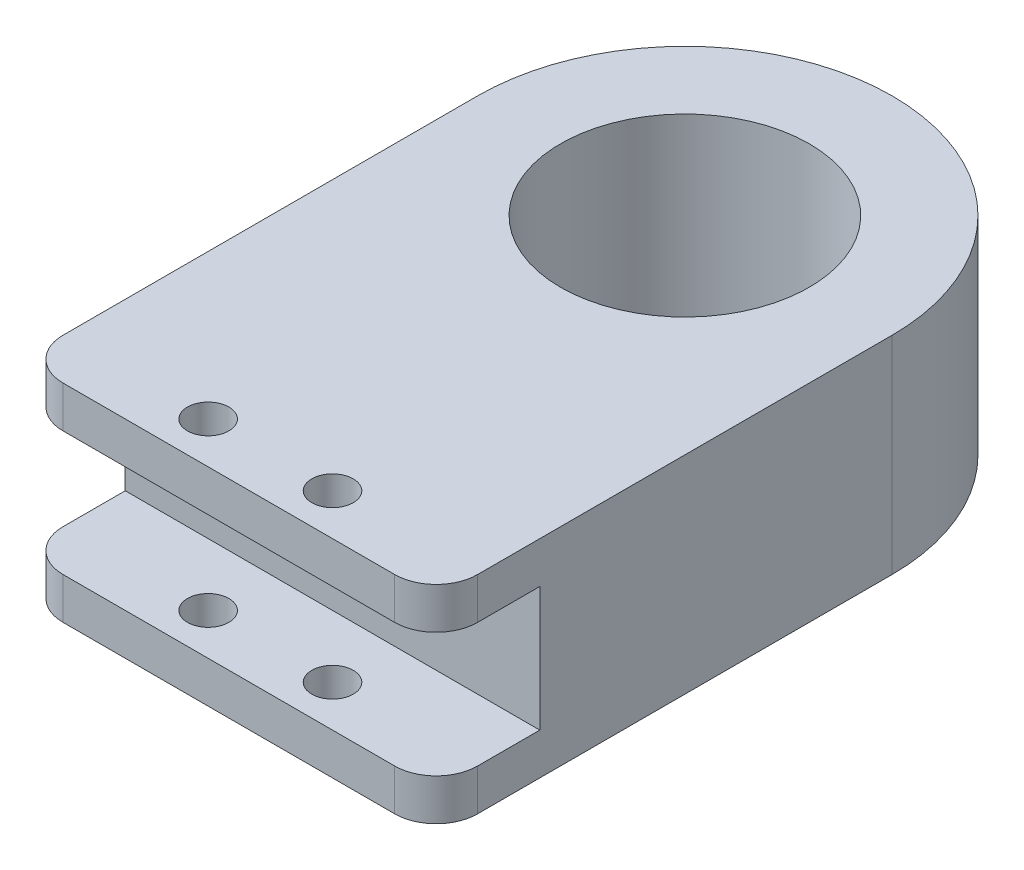
ISO-10303-21;
HEADER;
FILE_DESCRIPTION(('STEP AP214'),'2;1');
FILE_NAME('part.step','',(''),(''),'','','');
FILE_SCHEMA(('AUTOMOTIVE_DESIGN { 1 0 10303 214 1 1 1 1 }'));
ENDSEC;
DATA;
#1=APPLICATION_CONTEXT('core data for automotive mechanical design processes');
#2=APPLICATION_PROTOCOL_DEFINITION('international standard','automotive_design',2000,#1);
#3=PRODUCT_CONTEXT('',#1,'mechanical');
#4=PRODUCT('Part','Part','',(#3));
#5=PRODUCT_RELATED_PRODUCT_CATEGORY('part','',(#4));
#6=PRODUCT_DEFINITION_FORMATION('','',#4);
#7=PRODUCT_DEFINITION_CONTEXT('part definition',#1,'design');
#8=PRODUCT_DEFINITION('design','',#6,#7);
#9=PRODUCT_DEFINITION_SHAPE('','',#8);
#10=(LENGTH_UNIT() NAMED_UNIT(*) SI_UNIT(.MILLI.,.METRE.));
#11=(NAMED_UNIT(*) PLANE_ANGLE_UNIT() SI_UNIT($,.RADIAN.));
#12=(NAMED_UNIT(*) SI_UNIT($,.STERADIAN.) SOLID_ANGLE_UNIT());
#13=UNCERTAINTY_MEASURE_WITH_UNIT(LENGTH_MEASURE(1.E-05),#10,'distance_accuracy_value','');
#14=(GEOMETRIC_REPRESENTATION_CONTEXT(3) GLOBAL_UNCERTAINTY_ASSIGNED_CONTEXT((#13)) GLOBAL_UNIT_ASSIGNED_CONTEXT((#10,
#11,#12)) REPRESENTATION_CONTEXT('',''));
#15=CARTESIAN_POINT('',(0.,0.,0.));
#16=DIRECTION('',(0.,0.,1.));
#17=DIRECTION('',(1.,0.,0.));
#18=AXIS2_PLACEMENT_3D('',#15,#16,#17);
#19=CARTESIAN_POINT('',(-40.,50.,100.));
#20=DIRECTION('',(0.,-1.,0.));
#21=DIRECTION('',(0.,0.,-1.));
#22=AXIS2_PLACEMENT_3D('',#19,#20,#21);
#23=CYLINDRICAL_SURFACE('',#22,10.);
#24=DIRECTION('',(0.,-1.,0.));
#25=VECTOR('',#24,1.);
#26=CARTESIAN_POINT('',(-50.,50.,100.));
#27=LINE('',#26,#25);
#28=CARTESIAN_POINT('',(-50.,50.,100.));
#29=VERTEX_POINT('',#28);
#30=CARTESIAN_POINT('',(-50.,40.,100.));
#31=VERTEX_POINT('',#30);
#32=EDGE_CURVE('E158',#29,#31,#27,.T.);
#33=ORIENTED_EDGE('',*,*,#32,.T.);
#34=CARTESIAN_POINT('',(-40.,40.,100.));
#35=DIRECTION('',(0.,1.,0.));
#36=DIRECTION('',(0.,0.,1.));
#37=AXIS2_PLACEMENT_3D('',#34,#35,#36);
#38=CIRCLE('',#37,10.);
#39=CARTESIAN_POINT('',(-39.9999999999999,40.,110.));
#40=VERTEX_POINT('',#39);
#41=EDGE_CURVE('E122',#31,#40,#38,.T.);
#42=ORIENTED_EDGE('',*,*,#41,.T.);
#43=DIRECTION('',(0.,-1.,0.));
#44=VECTOR('',#43,1.);
#45=CARTESIAN_POINT('',(-39.9999999999999,50.,110.));
#46=LINE('',#45,#44);
#47=CARTESIAN_POINT('',(-39.9999999999999,50.,110.));
#48=VERTEX_POINT('',#47);
#49=EDGE_CURVE('E119',#48,#40,#46,.T.);
#50=ORIENTED_EDGE('',*,*,#49,.F.);
#51=CARTESIAN_POINT('',(-40.,50.,100.));
#52=DIRECTION('',(0.,1.,0.));
#53=DIRECTION('',(0.,0.,-1.));
#54=AXIS2_PLACEMENT_3D('',#51,#52,#53);
#55=CIRCLE('',#54,10.);
#56=EDGE_CURVE('E104',#29,#48,#55,.T.);
#57=ORIENTED_EDGE('',*,*,#56,.F.);
#58=EDGE_LOOP('',(#33,#42,#50,#57));
#59=FACE_BOUND('',#58,.T.);
#60=ADVANCED_FACE('F34',(#59),#23,.T.);
#61=CARTESIAN_POINT('',(39.9999999999999,50.,110.));
#62=DIRECTION('',(0.,0.,-1.));
#63=DIRECTION('',(-1.,0.,0.));
#64=AXIS2_PLACEMENT_3D('',#61,#62,#63);
#65=PLANE('',#64);
#66=ORIENTED_EDGE('',*,*,#49,.T.);
#67=DIRECTION('',(1.,0.,0.));
#68=VECTOR('',#67,1.);
#69=CARTESIAN_POINT('',(-50.,40.,110.));
#70=LINE('',#69,#68);
#71=CARTESIAN_POINT('',(40.,40.,110.));
#72=VERTEX_POINT('',#71);
#73=EDGE_CURVE('E164',#40,#72,#70,.T.);
#74=ORIENTED_EDGE('',*,*,#73,.T.);
#75=DIRECTION('',(0.,-1.,0.));
#76=VECTOR('',#75,1.);
#77=CARTESIAN_POINT('',(39.9999999999999,50.,110.));
#78=LINE('',#77,#76);
#79=CARTESIAN_POINT('',(39.9999999999999,50.,110.));
#80=VERTEX_POINT('',#79);
#81=EDGE_CURVE('E130',#80,#72,#78,.T.);
#82=ORIENTED_EDGE('',*,*,#81,.F.);
#83=DIRECTION('',(1.,0.,0.));
#84=VECTOR('',#83,1.);
#85=CARTESIAN_POINT('',(39.9999999999999,50.,110.));
#86=LINE('',#85,#84);
#87=EDGE_CURVE('E109',#48,#80,#86,.T.);
#88=ORIENTED_EDGE('',*,*,#87,.F.);
#89=EDGE_LOOP('',(#66,#74,#82,#88));
#90=FACE_BOUND('',#89,.T.);
#91=ADVANCED_FACE('F128',(#90),#65,.F.);
#92=CARTESIAN_POINT('',(40.,50.,100.));
#93=DIRECTION('',(0.,-1.,0.));
#94=DIRECTION('',(0.,0.,-1.));
#95=AXIS2_PLACEMENT_3D('',#92,#93,#94);
#96=CYLINDRICAL_SURFACE('',#95,10.);
#97=ORIENTED_EDGE('',*,*,#81,.T.);
#98=CARTESIAN_POINT('',(40.,40.,100.));
#99=DIRECTION('',(0.,1.,0.));
#100=DIRECTION('',(0.,0.,1.));
#101=AXIS2_PLACEMENT_3D('',#98,#99,#100);
#102=CIRCLE('',#101,10.);
#103=CARTESIAN_POINT('',(50.,40.,100.));
#104=VERTEX_POINT('',#103);
#105=EDGE_CURVE('E191',#72,#104,#102,.T.);
#106=ORIENTED_EDGE('',*,*,#105,.T.);
#107=DIRECTION('',(0.,-1.,0.));
#108=VECTOR('',#107,1.);
#109=CARTESIAN_POINT('',(50.,50.,100.));
#110=LINE('',#109,#108);
#111=CARTESIAN_POINT('',(50.,50.,100.));
#112=VERTEX_POINT('',#111);
#113=EDGE_CURVE('E154',#112,#104,#110,.T.);
#114=ORIENTED_EDGE('',*,*,#113,.F.);
#115=CARTESIAN_POINT('',(40.,50.,100.));
#116=DIRECTION('',(0.,1.,0.));
#117=DIRECTION('',(0.,0.,-1.));
#118=AXIS2_PLACEMENT_3D('',#115,#116,#117);
#119=CIRCLE('',#118,10.);
#120=EDGE_CURVE('E132',#80,#112,#119,.T.);
#121=ORIENTED_EDGE('',*,*,#120,.F.);
#122=EDGE_LOOP('',(#97,#106,#114,#121));
#123=FACE_BOUND('',#122,.T.);
#124=ADVANCED_FACE('F265',(#123),#96,.T.);
#125=CARTESIAN_POINT('',(-15.,50.,100.));
#126=DIRECTION('',(0.,-1.,0.));
#127=DIRECTION('',(0.,0.,-1.));
#128=AXIS2_PLACEMENT_3D('',#125,#126,#127);
#129=CYLINDRICAL_SURFACE('',#128,5.);
#130=CARTESIAN_POINT('',(-15.,40.,100.));
#131=DIRECTION('',(0.,1.,0.));
#132=DIRECTION('',(0.,0.,1.));
#133=AXIS2_PLACEMENT_3D('',#130,#131,#132);
#134=CIRCLE('',#133,5.);
#135=CARTESIAN_POINT('',(-15.,40.,105.));
#136=VERTEX_POINT('',#135);
#137=EDGE_CURVE('E188',#136,#136,#134,.T.);
#138=ORIENTED_EDGE('',*,*,#137,.F.);
#139=EDGE_LOOP('',(#138));
#140=FACE_BOUND('',#139,.T.);
#141=CARTESIAN_POINT('',(-15.,50.,100.));
#142=DIRECTION('',(0.,1.,0.));
#143=DIRECTION('',(0.,0.,1.));
#144=AXIS2_PLACEMENT_3D('',#141,#142,#143);
#145=CIRCLE('',#144,5.);
#146=CARTESIAN_POINT('',(-15.,50.,105.));
#147=VERTEX_POINT('',#146);
#148=EDGE_CURVE('E202',#147,#147,#145,.T.);
#149=ORIENTED_EDGE('',*,*,#148,.T.);
#150=EDGE_LOOP('',(#149));
#151=FACE_BOUND('',#150,.T.);
#152=ADVANCED_FACE('F267',(#140,#151),#129,.F.);
#153=CARTESIAN_POINT('',(15.,50.,100.));
#154=DIRECTION('',(0.,-1.,0.));
#155=DIRECTION('',(0.,0.,-1.));
#156=AXIS2_PLACEMENT_3D('',#153,#154,#155);
#157=CYLINDRICAL_SURFACE('',#156,5.);
#158=CARTESIAN_POINT('',(15.,40.,100.));
#159=DIRECTION('',(0.,1.,0.));
#160=DIRECTION('',(0.,0.,1.));
#161=AXIS2_PLACEMENT_3D('',#158,#159,#160);
#162=CIRCLE('',#161,5.);
#163=CARTESIAN_POINT('',(15.,40.,105.));
#164=VERTEX_POINT('',#163);
#165=EDGE_CURVE('E38',#164,#164,#162,.T.);
#166=ORIENTED_EDGE('',*,*,#165,.F.);
#167=EDGE_LOOP('',(#166));
#168=FACE_BOUND('',#167,.T.);
#169=CARTESIAN_POINT('',(15.,50.,100.));
#170=DIRECTION('',(0.,1.,0.));
#171=DIRECTION('',(0.,0.,-1.));
#172=AXIS2_PLACEMENT_3D('',#169,#170,#171);
#173=CIRCLE('',#172,5.);
#174=CARTESIAN_POINT('',(15.,50.,95.));
#175=VERTEX_POINT('',#174);
#176=EDGE_CURVE('E196',#175,#175,#173,.T.);
#177=ORIENTED_EDGE('',*,*,#176,.T.);
#178=EDGE_LOOP('',(#177));
#179=FACE_BOUND('',#178,.T.);
#180=ADVANCED_FACE('F274',(#168,#179),#157,.F.);
#181=CARTESIAN_POINT('',(0.,50.,0.));
#182=DIRECTION('',(0.,1.,0.));
#183=DIRECTION('',(0.,0.,1.));
#184=AXIS2_PLACEMENT_3D('',#181,#182,#183);
#185=PLANE('',#184);
#186=ORIENTED_EDGE('',*,*,#148,.F.);
#187=EDGE_LOOP('',(#186));
#188=FACE_BOUND('',#187,.T.);
#189=DIRECTION('',(0.,0.,-1.));
#190=VECTOR('',#189,1.);
#191=CARTESIAN_POINT('',(50.,50.,60.));
#192=LINE('',#191,#190);
#193=CARTESIAN_POINT('',(50.,50.,0.));
#194=VERTEX_POINT('',#193);
#195=EDGE_CURVE('E60',#112,#194,#192,.T.);
#196=ORIENTED_EDGE('',*,*,#195,.T.);
#197=CARTESIAN_POINT('',(0.,50.,0.));
#198=DIRECTION('',(0.,1.,0.));
#199=DIRECTION('',(0.,0.,1.));
#200=AXIS2_PLACEMENT_3D('',#197,#198,#199);
#201=CIRCLE('',#200,50.);
#202=CARTESIAN_POINT('',(-50.,50.,0.));
#203=VERTEX_POINT('',#202);
#204=EDGE_CURVE('E94',#194,#203,#201,.T.);
#205=ORIENTED_EDGE('',*,*,#204,.T.);
#206=DIRECTION('',(0.,0.,1.));
#207=VECTOR('',#206,1.);
#208=CARTESIAN_POINT('',(-50.,50.,60.));
#209=LINE('',#208,#207);
#210=EDGE_CURVE('E112',#203,#29,#209,.T.);
#211=ORIENTED_EDGE('',*,*,#210,.T.);
#212=ORIENTED_EDGE('',*,*,#56,.T.);
#213=ORIENTED_EDGE('',*,*,#87,.T.);
#214=ORIENTED_EDGE('',*,*,#120,.T.);
#215=EDGE_LOOP('',(#196,#205,#211,#212,#213,#214));
#216=FACE_BOUND('',#215,.T.);
#217=CARTESIAN_POINT('',(0.,50.,0.));
#218=DIRECTION('',(0.,1.,0.));
#219=DIRECTION('',(0.,0.,1.));
#220=AXIS2_PLACEMENT_3D('',#217,#218,#219);
#221=CIRCLE('',#220,30.);
#222=CARTESIAN_POINT('',(0.,50.,30.));
#223=VERTEX_POINT('',#222);
#224=EDGE_CURVE('E141',#223,#223,#221,.T.);
#225=ORIENTED_EDGE('',*,*,#224,.F.);
#226=EDGE_LOOP('',(#225));
#227=FACE_BOUND('',#226,.T.);
#228=ORIENTED_EDGE('',*,*,#176,.F.);
#229=EDGE_LOOP('',(#228));
#230=FACE_BOUND('',#229,.T.);
#231=ADVANCED_FACE('F106',(#188,#216,#227,#230),#185,.T.);
#232=CARTESIAN_POINT('',(0.,0.,0.));
#233=DIRECTION('',(0.,1.,0.));
#234=DIRECTION('',(0.,0.,1.));
#235=AXIS2_PLACEMENT_3D('',#232,#233,#234);
#236=PLANE('',#235);
#237=CARTESIAN_POINT('',(0.,0.,0.));
#238=DIRECTION('',(0.,1.,0.));
#239=DIRECTION('',(0.,0.,1.));
#240=AXIS2_PLACEMENT_3D('',#237,#238,#239);
#241=CIRCLE('',#240,50.);
#242=CARTESIAN_POINT('',(50.,0.,0.));
#243=VERTEX_POINT('',#242);
#244=CARTESIAN_POINT('',(-50.,0.,0.));
#245=VERTEX_POINT('',#244);
#246=EDGE_CURVE('E137',#243,#245,#241,.T.);
#247=ORIENTED_EDGE('',*,*,#246,.F.);
#248=DIRECTION('',(0.,0.,-1.));
#249=VECTOR('',#248,1.);
#250=CARTESIAN_POINT('',(50.,0.,60.));
#251=LINE('',#250,#249);
#252=CARTESIAN_POINT('',(50.,0.,100.));
#253=VERTEX_POINT('',#252);
#254=EDGE_CURVE('E152',#253,#243,#251,.T.);
#255=ORIENTED_EDGE('',*,*,#254,.F.);
#256=CARTESIAN_POINT('',(40.,0.,100.));
#257=DIRECTION('',(0.,1.,0.));
#258=DIRECTION('',(0.,0.,-1.));
#259=AXIS2_PLACEMENT_3D('',#256,#257,#258);
#260=CIRCLE('',#259,10.);
#261=CARTESIAN_POINT('',(39.9999999999999,0.,110.));
#262=VERTEX_POINT('',#261);
#263=EDGE_CURVE('E150',#262,#253,#260,.T.);
#264=ORIENTED_EDGE('',*,*,#263,.F.);
#265=DIRECTION('',(1.,0.,0.));
#266=VECTOR('',#265,1.);
#267=CARTESIAN_POINT('',(39.9999999999999,0.,110.));
#268=LINE('',#267,#266);
#269=CARTESIAN_POINT('',(-39.9999999999999,0.,110.));
#270=VERTEX_POINT('',#269);
#271=EDGE_CURVE('E147',#270,#262,#268,.T.);
#272=ORIENTED_EDGE('',*,*,#271,.F.);
#273=CARTESIAN_POINT('',(-40.,0.,100.));
#274=DIRECTION('',(0.,1.,0.));
#275=DIRECTION('',(0.,0.,-1.));
#276=AXIS2_PLACEMENT_3D('',#273,#274,#275);
#277=CIRCLE('',#276,10.);
#278=CARTESIAN_POINT('',(-50.,0.,100.));
#279=VERTEX_POINT('',#278);
#280=EDGE_CURVE('E144',#279,#270,#277,.T.);
#281=ORIENTED_EDGE('',*,*,#280,.F.);
#282=DIRECTION('',(0.,0.,1.));
#283=VECTOR('',#282,1.);
#284=CARTESIAN_POINT('',(-50.,0.,60.));
#285=LINE('',#284,#283);
#286=EDGE_CURVE('E140',#245,#279,#285,.T.);
#287=ORIENTED_EDGE('',*,*,#286,.F.);
#288=EDGE_LOOP('',(#247,#255,#264,#272,#281,#287));
#289=FACE_BOUND('',#288,.T.);
#290=CARTESIAN_POINT('',(0.,0.,0.));
#291=DIRECTION('',(0.,1.,0.));
#292=DIRECTION('',(0.,0.,1.));
#293=AXIS2_PLACEMENT_3D('',#290,#291,#292);
#294=CIRCLE('',#293,30.);
#295=CARTESIAN_POINT('',(0.,0.,30.));
#296=VERTEX_POINT('',#295);
#297=EDGE_CURVE('E205',#296,#296,#294,.T.);
#298=ORIENTED_EDGE('',*,*,#297,.T.);
#299=EDGE_LOOP('',(#298));
#300=FACE_BOUND('',#299,.T.);
#301=CARTESIAN_POINT('',(-15.,0.,100.));
#302=DIRECTION('',(0.,1.,0.));
#303=DIRECTION('',(0.,0.,1.));
#304=AXIS2_PLACEMENT_3D('',#301,#302,#303);
#305=CIRCLE('',#304,5.);
#306=CARTESIAN_POINT('',(-15.,0.,105.));
#307=VERTEX_POINT('',#306);
#308=EDGE_CURVE('E199',#307,#307,#305,.T.);
#309=ORIENTED_EDGE('',*,*,#308,.T.);
#310=EDGE_LOOP('',(#309));
#311=FACE_BOUND('',#310,.T.);
#312=CARTESIAN_POINT('',(15.,0.,100.));
#313=DIRECTION('',(0.,1.,0.));
#314=DIRECTION('',(0.,0.,-1.));
#315=AXIS2_PLACEMENT_3D('',#312,#313,#314);
#316=CIRCLE('',#315,5.);
#317=CARTESIAN_POINT('',(15.,0.,95.));
#318=VERTEX_POINT('',#317);
#319=EDGE_CURVE('E195',#318,#318,#316,.T.);
#320=ORIENTED_EDGE('',*,*,#319,.T.);
#321=EDGE_LOOP('',(#320));
#322=FACE_BOUND('',#321,.T.);
#323=ADVANCED_FACE('F303',(#289,#300,#311,#322),#236,.F.);
#324=CARTESIAN_POINT('',(0.,50.,0.));
#325=DIRECTION('',(0.,-1.,0.));
#326=DIRECTION('',(0.,0.,-1.));
#327=AXIS2_PLACEMENT_3D('',#324,#325,#326);
#328=CYLINDRICAL_SURFACE('',#327,50.);
#329=ORIENTED_EDGE('',*,*,#246,.T.);
#330=DIRECTION('',(0.,-1.,0.));
#331=VECTOR('',#330,1.);
#332=CARTESIAN_POINT('',(-50.,50.,0.));
#333=LINE('',#332,#331);
#334=EDGE_CURVE('E43',#203,#245,#333,.T.);
#335=ORIENTED_EDGE('',*,*,#334,.F.);
#336=ORIENTED_EDGE('',*,*,#204,.F.);
#337=DIRECTION('',(0.,-1.,0.));
#338=VECTOR('',#337,1.);
#339=CARTESIAN_POINT('',(50.,50.,0.));
#340=LINE('',#339,#338);
#341=EDGE_CURVE('E11',#194,#243,#340,.T.);
#342=ORIENTED_EDGE('',*,*,#341,.T.);
#343=EDGE_LOOP('',(#329,#335,#336,#342));
#344=FACE_BOUND('',#343,.T.);
#345=ADVANCED_FACE('F36',(#344),#328,.T.);
#346=CARTESIAN_POINT('',(-50.,50.,60.));
#347=DIRECTION('',(1.,0.,0.));
#348=DIRECTION('',(0.,0.,-1.));
#349=AXIS2_PLACEMENT_3D('',#346,#347,#348);
#350=PLANE('',#349);
#351=DIRECTION('',(0.,1.,0.));
#352=VECTOR('',#351,1.);
#353=CARTESIAN_POINT('',(-50.,40.,85.));
#354=LINE('',#353,#352);
#355=CARTESIAN_POINT('',(-50.,10.,85.));
#356=VERTEX_POINT('',#355);
#357=CARTESIAN_POINT('',(-50.,40.,85.));
#358=VERTEX_POINT('',#357);
#359=EDGE_CURVE('E251',#356,#358,#354,.T.);
#360=ORIENTED_EDGE('',*,*,#359,.T.);
#361=DIRECTION('',(0.,0.,1.));
#362=VECTOR('',#361,1.);
#363=CARTESIAN_POINT('',(-50.,40.,110.));
#364=LINE('',#363,#362);
#365=EDGE_CURVE('E182',#358,#31,#364,.T.);
#366=ORIENTED_EDGE('',*,*,#365,.T.);
#367=ORIENTED_EDGE('',*,*,#32,.F.);
#368=ORIENTED_EDGE('',*,*,#210,.F.);
#369=ORIENTED_EDGE('',*,*,#334,.T.);
#370=ORIENTED_EDGE('',*,*,#286,.T.);
#371=CARTESIAN_POINT('',(-50.,10.,100.));
#372=VERTEX_POINT('',#371);
#373=EDGE_CURVE('E125',#372,#279,#27,.T.);
#374=ORIENTED_EDGE('',*,*,#373,.F.);
#375=DIRECTION('',(0.,0.,-1.));
#376=VECTOR('',#375,1.);
#377=CARTESIAN_POINT('',(-50.,10.,110.));
#378=LINE('',#377,#376);
#379=EDGE_CURVE('E246',#372,#356,#378,.T.);
#380=ORIENTED_EDGE('',*,*,#379,.T.);
#381=EDGE_LOOP('',(#360,#366,#367,#368,#369,#370,#374,#380));
#382=FACE_BOUND('',#381,.T.);
#383=ADVANCED_FACE('F216',(#382),#350,.F.);
#384=CARTESIAN_POINT('',(-39.9999999999999,10.,110.));
#385=VERTEX_POINT('',#384);
#386=EDGE_CURVE('E126',#385,#270,#46,.T.);
#387=ORIENTED_EDGE('',*,*,#386,.F.);
#388=CARTESIAN_POINT('',(-40.,10.,100.));
#389=DIRECTION('',(0.,-1.,0.));
#390=DIRECTION('',(0.,0.,-1.));
#391=AXIS2_PLACEMENT_3D('',#388,#389,#390);
#392=CIRCLE('',#391,10.);
#393=EDGE_CURVE('E185',#385,#372,#392,.T.);
#394=ORIENTED_EDGE('',*,*,#393,.T.);
#395=ORIENTED_EDGE('',*,*,#373,.T.);
#396=ORIENTED_EDGE('',*,*,#280,.T.);
#397=EDGE_LOOP('',(#387,#394,#395,#396));
#398=FACE_BOUND('',#397,.T.);
#399=ADVANCED_FACE('F285',(#398),#23,.T.);
#400=CARTESIAN_POINT('',(40.,10.,110.));
#401=VERTEX_POINT('',#400);
#402=EDGE_CURVE('E156',#401,#262,#78,.T.);
#403=ORIENTED_EDGE('',*,*,#402,.F.);
#404=DIRECTION('',(1.,0.,0.));
#405=VECTOR('',#404,1.);
#406=CARTESIAN_POINT('',(-50.,10.,110.));
#407=LINE('',#406,#405);
#408=EDGE_CURVE('E181',#385,#401,#407,.T.);
#409=ORIENTED_EDGE('',*,*,#408,.F.);
#410=ORIENTED_EDGE('',*,*,#386,.T.);
#411=ORIENTED_EDGE('',*,*,#271,.T.);
#412=EDGE_LOOP('',(#403,#409,#410,#411));
#413=FACE_BOUND('',#412,.T.);
#414=ADVANCED_FACE('F279',(#413),#65,.F.);
#415=CARTESIAN_POINT('',(50.,10.,100.));
#416=VERTEX_POINT('',#415);
#417=EDGE_CURVE('E86',#416,#253,#110,.T.);
#418=ORIENTED_EDGE('',*,*,#417,.F.);
#419=CARTESIAN_POINT('',(40.,10.,100.));
#420=DIRECTION('',(0.,-1.,0.));
#421=DIRECTION('',(0.,0.,-1.));
#422=AXIS2_PLACEMENT_3D('',#419,#420,#421);
#423=CIRCLE('',#422,10.);
#424=EDGE_CURVE('E51',#416,#401,#423,.T.);
#425=ORIENTED_EDGE('',*,*,#424,.T.);
#426=ORIENTED_EDGE('',*,*,#402,.T.);
#427=ORIENTED_EDGE('',*,*,#263,.T.);
#428=EDGE_LOOP('',(#418,#425,#426,#427));
#429=FACE_BOUND('',#428,.T.);
#430=ADVANCED_FACE('F269',(#429),#96,.T.);
#431=CARTESIAN_POINT('',(50.,50.,60.));
#432=DIRECTION('',(-1.,0.,0.));
#433=DIRECTION('',(0.,0.,1.));
#434=AXIS2_PLACEMENT_3D('',#431,#432,#433);
#435=PLANE('',#434);
#436=ORIENTED_EDGE('',*,*,#113,.T.);
#437=DIRECTION('',(0.,0.,1.));
#438=VECTOR('',#437,1.);
#439=CARTESIAN_POINT('',(50.,40.,110.));
#440=LINE('',#439,#438);
#441=CARTESIAN_POINT('',(50.,40.,85.));
#442=VERTEX_POINT('',#441);
#443=EDGE_CURVE('E176',#442,#104,#440,.T.);
#444=ORIENTED_EDGE('',*,*,#443,.F.);
#445=DIRECTION('',(0.,1.,0.));
#446=VECTOR('',#445,1.);
#447=CARTESIAN_POINT('',(50.,40.,85.));
#448=LINE('',#447,#446);
#449=CARTESIAN_POINT('',(50.,10.,85.));
#450=VERTEX_POINT('',#449);
#451=EDGE_CURVE('E256',#450,#442,#448,.T.);
#452=ORIENTED_EDGE('',*,*,#451,.F.);
#453=DIRECTION('',(0.,0.,-1.));
#454=VECTOR('',#453,1.);
#455=CARTESIAN_POINT('',(50.,10.,110.));
#456=LINE('',#455,#454);
#457=EDGE_CURVE('E247',#416,#450,#456,.T.);
#458=ORIENTED_EDGE('',*,*,#457,.F.);
#459=ORIENTED_EDGE('',*,*,#417,.T.);
#460=ORIENTED_EDGE('',*,*,#254,.T.);
#461=ORIENTED_EDGE('',*,*,#341,.F.);
#462=ORIENTED_EDGE('',*,*,#195,.F.);
#463=EDGE_LOOP('',(#436,#444,#452,#458,#459,#460,#461,#462));
#464=FACE_BOUND('',#463,.T.);
#465=ADVANCED_FACE('F260',(#464),#435,.F.);
#466=CARTESIAN_POINT('',(0.,50.,0.));
#467=DIRECTION('',(0.,-1.,0.));
#468=DIRECTION('',(0.,0.,-1.));
#469=AXIS2_PLACEMENT_3D('',#466,#467,#468);
#470=CYLINDRICAL_SURFACE('',#469,30.);
#471=ORIENTED_EDGE('',*,*,#224,.T.);
#472=EDGE_LOOP('',(#471));
#473=FACE_BOUND('',#472,.T.);
#474=ORIENTED_EDGE('',*,*,#297,.F.);
#475=EDGE_LOOP('',(#474));
#476=FACE_BOUND('',#475,.T.);
#477=ADVANCED_FACE('F323',(#473,#476),#470,.F.);
#478=CARTESIAN_POINT('',(-15.,10.,100.));
#479=DIRECTION('',(0.,-1.,0.));
#480=DIRECTION('',(0.,0.,-1.));
#481=AXIS2_PLACEMENT_3D('',#478,#479,#480);
#482=CIRCLE('',#481,5.);
#483=CARTESIAN_POINT('',(-15.,10.,95.));
#484=VERTEX_POINT('',#483);
#485=EDGE_CURVE('E163',#484,#484,#482,.T.);
#486=ORIENTED_EDGE('',*,*,#485,.F.);
#487=EDGE_LOOP('',(#486));
#488=FACE_BOUND('',#487,.T.);
#489=ORIENTED_EDGE('',*,*,#308,.F.);
#490=EDGE_LOOP('',(#489));
#491=FACE_BOUND('',#490,.T.);
#492=ADVANCED_FACE('F277',(#488,#491),#129,.F.);
#493=CARTESIAN_POINT('',(15.,10.,100.));
#494=DIRECTION('',(0.,-1.,0.));
#495=DIRECTION('',(0.,0.,-1.));
#496=AXIS2_PLACEMENT_3D('',#493,#494,#495);
#497=CIRCLE('',#496,5.);
#498=CARTESIAN_POINT('',(15.,10.,95.));
#499=VERTEX_POINT('',#498);
#500=EDGE_CURVE('E161',#499,#499,#497,.T.);
#501=ORIENTED_EDGE('',*,*,#500,.F.);
#502=EDGE_LOOP('',(#501));
#503=FACE_BOUND('',#502,.T.);
#504=ORIENTED_EDGE('',*,*,#319,.F.);
#505=EDGE_LOOP('',(#504));
#506=FACE_BOUND('',#505,.T.);
#507=ADVANCED_FACE('F313',(#503,#506),#157,.F.);
#508=CARTESIAN_POINT('',(-50.,40.,110.));
#509=DIRECTION('',(0.,1.,0.));
#510=DIRECTION('',(0.,0.,1.));
#511=AXIS2_PLACEMENT_3D('',#508,#509,#510);
#512=PLANE('',#511);
#513=ORIENTED_EDGE('',*,*,#137,.T.);
#514=EDGE_LOOP('',(#513));
#515=FACE_BOUND('',#514,.T.);
#516=ORIENTED_EDGE('',*,*,#165,.T.);
#517=EDGE_LOOP('',(#516));
#518=FACE_BOUND('',#517,.T.);
#519=ORIENTED_EDGE('',*,*,#365,.F.);
#520=DIRECTION('',(1.,0.,0.));
#521=VECTOR('',#520,1.);
#522=CARTESIAN_POINT('',(-50.,40.,85.));
#523=LINE('',#522,#521);
#524=EDGE_CURVE('E169',#358,#442,#523,.T.);
#525=ORIENTED_EDGE('',*,*,#524,.T.);
#526=ORIENTED_EDGE('',*,*,#443,.T.);
#527=ORIENTED_EDGE('',*,*,#105,.F.);
#528=ORIENTED_EDGE('',*,*,#73,.F.);
#529=ORIENTED_EDGE('',*,*,#41,.F.);
#530=EDGE_LOOP('',(#519,#525,#526,#527,#528,#529));
#531=FACE_BOUND('',#530,.T.);
#532=ADVANCED_FACE('F263',(#515,#518,#531),#512,.F.);
#533=CARTESIAN_POINT('',(-50.,10.,110.));
#534=DIRECTION('',(0.,-1.,0.));
#535=DIRECTION('',(0.,0.,-1.));
#536=AXIS2_PLACEMENT_3D('',#533,#534,#535);
#537=PLANE('',#536);
#538=ORIENTED_EDGE('',*,*,#485,.T.);
#539=EDGE_LOOP('',(#538));
#540=FACE_BOUND('',#539,.T.);
#541=ORIENTED_EDGE('',*,*,#500,.T.);
#542=EDGE_LOOP('',(#541));
#543=FACE_BOUND('',#542,.T.);
#544=ORIENTED_EDGE('',*,*,#408,.T.);
#545=ORIENTED_EDGE('',*,*,#424,.F.);
#546=ORIENTED_EDGE('',*,*,#457,.T.);
#547=DIRECTION('',(1.,0.,0.));
#548=VECTOR('',#547,1.);
#549=CARTESIAN_POINT('',(-50.,10.,85.));
#550=LINE('',#549,#548);
#551=EDGE_CURVE('E173',#356,#450,#550,.T.);
#552=ORIENTED_EDGE('',*,*,#551,.F.);
#553=ORIENTED_EDGE('',*,*,#379,.F.);
#554=ORIENTED_EDGE('',*,*,#393,.F.);
#555=EDGE_LOOP('',(#544,#545,#546,#552,#553,#554));
#556=FACE_BOUND('',#555,.T.);
#557=ADVANCED_FACE('F244',(#540,#543,#556),#537,.F.);
#558=CARTESIAN_POINT('',(-50.,40.,85.));
#559=DIRECTION('',(0.,0.,-1.));
#560=DIRECTION('',(-1.,0.,0.));
#561=AXIS2_PLACEMENT_3D('',#558,#559,#560);
#562=PLANE('',#561);
#563=ORIENTED_EDGE('',*,*,#451,.T.);
#564=ORIENTED_EDGE('',*,*,#524,.F.);
#565=ORIENTED_EDGE('',*,*,#359,.F.);
#566=ORIENTED_EDGE('',*,*,#551,.T.);
#567=EDGE_LOOP('',(#563,#564,#565,#566));
#568=FACE_BOUND('',#567,.T.);
#569=ADVANCED_FACE('F252',(#568),#562,.F.);
#570=CLOSED_SHELL('',(#60,#91,#124,#152,#180,#231,#323,#345,#383,#399,#414,#430,#465,#477,#492,
#507,#532,#557,#569));
#571=MANIFOLD_SOLID_BREP('B2',#570);
#572=ADVANCED_BREP_SHAPE_REPRESENTATION('',(#18,#571),#14);
#573=SHAPE_DEFINITION_REPRESENTATION(#9,#572);
ENDSEC;
END-ISO-10303-21;
